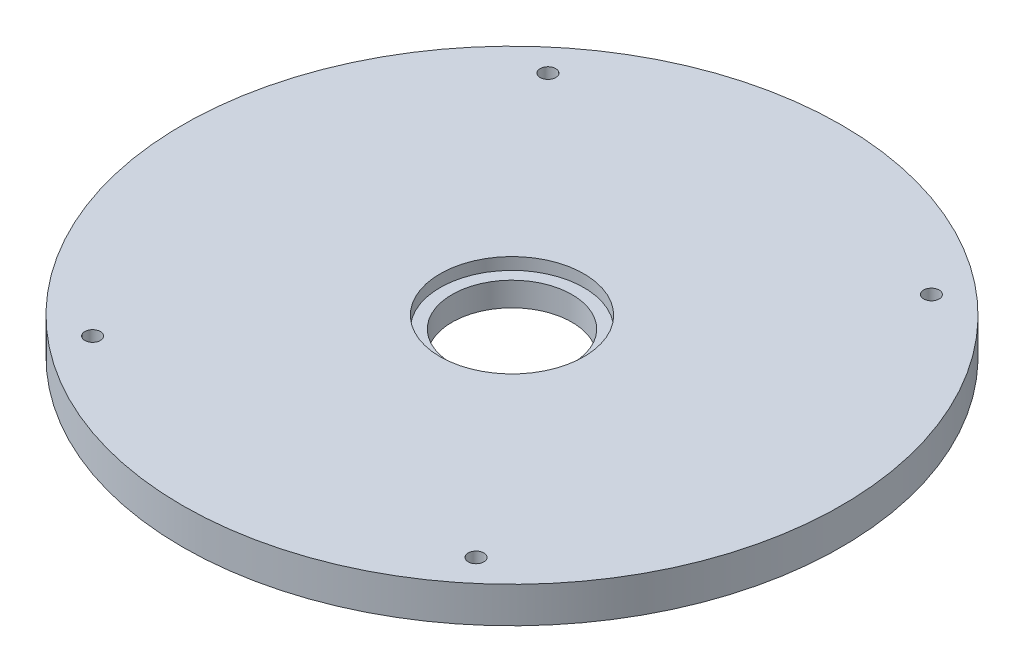
ISO-10303-21;
HEADER;
FILE_DESCRIPTION(('STEP AP214'),'2;1');
FILE_NAME('part.step','',(''),(''),'','','');
FILE_SCHEMA(('AUTOMOTIVE_DESIGN { 1 0 10303 214 1 1 1 1 }'));
ENDSEC;
DATA;
#1=APPLICATION_CONTEXT('core data for automotive mechanical design processes');
#2=APPLICATION_PROTOCOL_DEFINITION('international standard','automotive_design',2000,#1);
#3=PRODUCT_CONTEXT('',#1,'mechanical');
#4=PRODUCT('Part','Part','',(#3));
#5=PRODUCT_RELATED_PRODUCT_CATEGORY('part','',(#4));
#6=PRODUCT_DEFINITION_FORMATION('','',#4);
#7=PRODUCT_DEFINITION_CONTEXT('part definition',#1,'design');
#8=PRODUCT_DEFINITION('design','',#6,#7);
#9=PRODUCT_DEFINITION_SHAPE('','',#8);
#10=(LENGTH_UNIT() NAMED_UNIT(*) SI_UNIT(.MILLI.,.METRE.));
#11=(NAMED_UNIT(*) PLANE_ANGLE_UNIT() SI_UNIT($,.RADIAN.));
#12=(NAMED_UNIT(*) SI_UNIT($,.STERADIAN.) SOLID_ANGLE_UNIT());
#13=UNCERTAINTY_MEASURE_WITH_UNIT(LENGTH_MEASURE(1.E-05),#10,'distance_accuracy_value','');
#14=(GEOMETRIC_REPRESENTATION_CONTEXT(3) GLOBAL_UNCERTAINTY_ASSIGNED_CONTEXT((#13)) GLOBAL_UNIT_ASSIGNED_CONTEXT((#10,
#11,#12)) REPRESENTATION_CONTEXT('',''));
#15=CARTESIAN_POINT('',(0.,0.,0.));
#16=DIRECTION('',(0.,0.,1.));
#17=DIRECTION('',(1.,0.,0.));
#18=AXIS2_PLACEMENT_3D('',#15,#16,#17);
#19=CARTESIAN_POINT('',(0.,15.001,0.));
#20=DIRECTION('',(0.,-1.,0.));
#21=DIRECTION('',(0.,0.,-1.));
#22=AXIS2_PLACEMENT_3D('',#19,#20,#21);
#23=CYLINDRICAL_SURFACE('',#22,25.);
#24=CARTESIAN_POINT('',(0.,0.,0.));
#25=DIRECTION('',(0.,1.,0.));
#26=DIRECTION('',(0.,0.,1.));
#27=AXIS2_PLACEMENT_3D('',#24,#25,#26);
#28=CIRCLE('',#27,25.);
#29=CARTESIAN_POINT('',(0.,0.,25.));
#30=VERTEX_POINT('',#29);
#31=EDGE_CURVE('E59',#30,#30,#28,.T.);
#32=ORIENTED_EDGE('',*,*,#31,.F.);
#33=EDGE_LOOP('',(#32));
#34=FACE_BOUND('',#33,.T.);
#35=CARTESIAN_POINT('',(0.,10.,0.));
#36=DIRECTION('',(0.,1.,0.));
#37=DIRECTION('',(0.,0.,1.));
#38=AXIS2_PLACEMENT_3D('',#35,#36,#37);
#39=CIRCLE('',#38,25.);
#40=CARTESIAN_POINT('',(0.,10.,25.));
#41=VERTEX_POINT('',#40);
#42=EDGE_CURVE('E35',#41,#41,#39,.T.);
#43=ORIENTED_EDGE('',*,*,#42,.T.);
#44=EDGE_LOOP('',(#43));
#45=FACE_BOUND('',#44,.T.);
#46=ADVANCED_FACE('F31',(#34,#45),#23,.F.);
#47=CARTESIAN_POINT('',(0.,15.,0.));
#48=DIRECTION('',(0.,-1.,0.));
#49=DIRECTION('',(0.,0.,-1.));
#50=AXIS2_PLACEMENT_3D('',#47,#48,#49);
#51=CYLINDRICAL_SURFACE('',#50,137.5);
#52=CARTESIAN_POINT('',(0.,15.,0.));
#53=DIRECTION('',(0.,1.,0.));
#54=DIRECTION('',(0.,0.,1.));
#55=AXIS2_PLACEMENT_3D('',#52,#53,#54);
#56=CIRCLE('',#55,137.5);
#57=CARTESIAN_POINT('',(0.,15.,137.5));
#58=VERTEX_POINT('',#57);
#59=EDGE_CURVE('E10',#58,#58,#56,.T.);
#60=ORIENTED_EDGE('',*,*,#59,.F.);
#61=EDGE_LOOP('',(#60));
#62=FACE_BOUND('',#61,.T.);
#63=CARTESIAN_POINT('',(0.,0.,0.));
#64=DIRECTION('',(0.,1.,0.));
#65=DIRECTION('',(0.,0.,1.));
#66=AXIS2_PLACEMENT_3D('',#63,#64,#65);
#67=CIRCLE('',#66,137.5);
#68=CARTESIAN_POINT('',(0.,0.,137.5));
#69=VERTEX_POINT('',#68);
#70=EDGE_CURVE('E39',#69,#69,#67,.T.);
#71=ORIENTED_EDGE('',*,*,#70,.T.);
#72=EDGE_LOOP('',(#71));
#73=FACE_BOUND('',#72,.T.);
#74=ADVANCED_FACE('F33',(#62,#73),#51,.T.);
#75=CARTESIAN_POINT('',(0.,15.,0.));
#76=DIRECTION('',(0.,1.,0.));
#77=DIRECTION('',(0.,0.,1.));
#78=AXIS2_PLACEMENT_3D('',#75,#76,#77);
#79=PLANE('',#78);
#80=CARTESIAN_POINT('',(0.,15.,0.));
#81=DIRECTION('',(0.,1.,0.));
#82=DIRECTION('',(0.,0.,1.));
#83=AXIS2_PLACEMENT_3D('',#80,#81,#82);
#84=CIRCLE('',#83,30.);
#85=CARTESIAN_POINT('',(0.,15.,30.));
#86=VERTEX_POINT('',#85);
#87=EDGE_CURVE('E72',#86,#86,#84,.T.);
#88=ORIENTED_EDGE('',*,*,#87,.F.);
#89=EDGE_LOOP('',(#88));
#90=FACE_BOUND('',#89,.T.);
#91=CARTESIAN_POINT('',(80.,15.,-95.));
#92=DIRECTION('',(0.,1.,0.));
#93=DIRECTION('',(0.,0.,1.));
#94=AXIS2_PLACEMENT_3D('',#91,#92,#93);
#95=CIRCLE('',#94,3.25000000000001);
#96=CARTESIAN_POINT('',(80.,15.,-91.75));
#97=VERTEX_POINT('',#96);
#98=EDGE_CURVE('E52',#97,#97,#95,.T.);
#99=ORIENTED_EDGE('',*,*,#98,.F.);
#100=EDGE_LOOP('',(#99));
#101=FACE_BOUND('',#100,.T.);
#102=CARTESIAN_POINT('',(80.,15.,95.));
#103=DIRECTION('',(0.,1.,0.));
#104=DIRECTION('',(0.,0.,1.));
#105=AXIS2_PLACEMENT_3D('',#102,#103,#104);
#106=CIRCLE('',#105,3.25000000000001);
#107=CARTESIAN_POINT('',(80.,15.,98.25));
#108=VERTEX_POINT('',#107);
#109=EDGE_CURVE('E60',#108,#108,#106,.T.);
#110=ORIENTED_EDGE('',*,*,#109,.F.);
#111=EDGE_LOOP('',(#110));
#112=FACE_BOUND('',#111,.T.);
#113=CARTESIAN_POINT('',(-80.,15.,95.));
#114=DIRECTION('',(0.,1.,0.));
#115=DIRECTION('',(0.,0.,1.));
#116=AXIS2_PLACEMENT_3D('',#113,#114,#115);
#117=CIRCLE('',#116,3.25000000000001);
#118=CARTESIAN_POINT('',(-80.,15.,98.25));
#119=VERTEX_POINT('',#118);
#120=EDGE_CURVE('E51',#119,#119,#117,.T.);
#121=ORIENTED_EDGE('',*,*,#120,.F.);
#122=EDGE_LOOP('',(#121));
#123=FACE_BOUND('',#122,.T.);
#124=CARTESIAN_POINT('',(-80.,15.,-95.));
#125=DIRECTION('',(0.,1.,0.));
#126=DIRECTION('',(0.,0.,1.));
#127=AXIS2_PLACEMENT_3D('',#124,#125,#126);
#128=CIRCLE('',#127,3.25000000000001);
#129=CARTESIAN_POINT('',(-80.,15.,-91.75));
#130=VERTEX_POINT('',#129);
#131=EDGE_CURVE('E44',#130,#130,#128,.T.);
#132=ORIENTED_EDGE('',*,*,#131,.F.);
#133=EDGE_LOOP('',(#132));
#134=FACE_BOUND('',#133,.T.);
#135=ORIENTED_EDGE('',*,*,#59,.T.);
#136=EDGE_LOOP('',(#135));
#137=FACE_BOUND('',#136,.T.);
#138=ADVANCED_FACE('F99',(#90,#101,#112,#123,#134,#137),#79,.T.);
#139=CARTESIAN_POINT('',(0.,0.,0.));
#140=DIRECTION('',(0.,1.,0.));
#141=DIRECTION('',(0.,0.,1.));
#142=AXIS2_PLACEMENT_3D('',#139,#140,#141);
#143=PLANE('',#142);
#144=ORIENTED_EDGE('',*,*,#31,.T.);
#145=EDGE_LOOP('',(#144));
#146=FACE_BOUND('',#145,.T.);
#147=CARTESIAN_POINT('',(80.,0.,-95.));
#148=DIRECTION('',(0.,1.,0.));
#149=DIRECTION('',(0.,0.,1.));
#150=AXIS2_PLACEMENT_3D('',#147,#148,#149);
#151=CIRCLE('',#150,3.25000000000001);
#152=CARTESIAN_POINT('',(80.,0.,-91.75));
#153=VERTEX_POINT('',#152);
#154=EDGE_CURVE('E56',#153,#153,#151,.T.);
#155=ORIENTED_EDGE('',*,*,#154,.T.);
#156=EDGE_LOOP('',(#155));
#157=FACE_BOUND('',#156,.T.);
#158=CARTESIAN_POINT('',(80.,0.,95.));
#159=DIRECTION('',(0.,1.,0.));
#160=DIRECTION('',(0.,0.,1.));
#161=AXIS2_PLACEMENT_3D('',#158,#159,#160);
#162=CIRCLE('',#161,3.25000000000001);
#163=CARTESIAN_POINT('',(80.,0.,98.25));
#164=VERTEX_POINT('',#163);
#165=EDGE_CURVE('E55',#164,#164,#162,.T.);
#166=ORIENTED_EDGE('',*,*,#165,.T.);
#167=EDGE_LOOP('',(#166));
#168=FACE_BOUND('',#167,.T.);
#169=CARTESIAN_POINT('',(-80.,0.,95.));
#170=DIRECTION('',(0.,1.,0.));
#171=DIRECTION('',(0.,0.,1.));
#172=AXIS2_PLACEMENT_3D('',#169,#170,#171);
#173=CIRCLE('',#172,3.25000000000001);
#174=CARTESIAN_POINT('',(-80.,0.,98.25));
#175=VERTEX_POINT('',#174);
#176=EDGE_CURVE('E63',#175,#175,#173,.T.);
#177=ORIENTED_EDGE('',*,*,#176,.T.);
#178=EDGE_LOOP('',(#177));
#179=FACE_BOUND('',#178,.T.);
#180=CARTESIAN_POINT('',(-80.,0.,-95.));
#181=DIRECTION('',(0.,1.,0.));
#182=DIRECTION('',(0.,0.,1.));
#183=AXIS2_PLACEMENT_3D('',#180,#181,#182);
#184=CIRCLE('',#183,3.25000000000001);
#185=CARTESIAN_POINT('',(-80.,0.,-91.75));
#186=VERTEX_POINT('',#185);
#187=EDGE_CURVE('E48',#186,#186,#184,.T.);
#188=ORIENTED_EDGE('',*,*,#187,.T.);
#189=EDGE_LOOP('',(#188));
#190=FACE_BOUND('',#189,.T.);
#191=ORIENTED_EDGE('',*,*,#70,.F.);
#192=EDGE_LOOP('',(#191));
#193=FACE_BOUND('',#192,.T.);
#194=ADVANCED_FACE('F117',(#146,#157,#168,#179,#190,#193),#143,.F.);
#195=CARTESIAN_POINT('',(-80.,24.1923881554251,-95.));
#196=DIRECTION('',(0.,-1.,0.));
#197=DIRECTION('',(0.,0.,-1.));
#198=AXIS2_PLACEMENT_3D('',#195,#196,#197);
#199=CYLINDRICAL_SURFACE('',#198,3.25000000000001);
#200=ORIENTED_EDGE('',*,*,#187,.F.);
#201=EDGE_LOOP('',(#200));
#202=FACE_BOUND('',#201,.T.);
#203=ORIENTED_EDGE('',*,*,#131,.T.);
#204=EDGE_LOOP('',(#203));
#205=FACE_BOUND('',#204,.T.);
#206=ADVANCED_FACE('F107',(#202,#205),#199,.F.);
#207=CARTESIAN_POINT('',(-80.,24.1923881554251,95.));
#208=DIRECTION('',(0.,-1.,0.));
#209=DIRECTION('',(0.,0.,-1.));
#210=AXIS2_PLACEMENT_3D('',#207,#208,#209);
#211=CYLINDRICAL_SURFACE('',#210,3.25000000000001);
#212=ORIENTED_EDGE('',*,*,#176,.F.);
#213=EDGE_LOOP('',(#212));
#214=FACE_BOUND('',#213,.T.);
#215=ORIENTED_EDGE('',*,*,#120,.T.);
#216=EDGE_LOOP('',(#215));
#217=FACE_BOUND('',#216,.T.);
#218=ADVANCED_FACE('F103',(#214,#217),#211,.F.);
#219=CARTESIAN_POINT('',(80.,24.1923881554251,95.));
#220=DIRECTION('',(0.,-1.,0.));
#221=DIRECTION('',(0.,0.,-1.));
#222=AXIS2_PLACEMENT_3D('',#219,#220,#221);
#223=CYLINDRICAL_SURFACE('',#222,3.25000000000001);
#224=ORIENTED_EDGE('',*,*,#165,.F.);
#225=EDGE_LOOP('',(#224));
#226=FACE_BOUND('',#225,.T.);
#227=ORIENTED_EDGE('',*,*,#109,.T.);
#228=EDGE_LOOP('',(#227));
#229=FACE_BOUND('',#228,.T.);
#230=ADVANCED_FACE('F106',(#226,#229),#223,.F.);
#231=CARTESIAN_POINT('',(80.,24.1923881554251,-95.));
#232=DIRECTION('',(0.,-1.,0.));
#233=DIRECTION('',(0.,0.,-1.));
#234=AXIS2_PLACEMENT_3D('',#231,#232,#233);
#235=CYLINDRICAL_SURFACE('',#234,3.25000000000001);
#236=ORIENTED_EDGE('',*,*,#154,.F.);
#237=EDGE_LOOP('',(#236));
#238=FACE_BOUND('',#237,.T.);
#239=ORIENTED_EDGE('',*,*,#98,.T.);
#240=EDGE_LOOP('',(#239));
#241=FACE_BOUND('',#240,.T.);
#242=ADVANCED_FACE('F90',(#238,#241),#235,.F.);
#243=CARTESIAN_POINT('',(0.,10.,0.));
#244=DIRECTION('',(0.,1.,0.));
#245=DIRECTION('',(0.,0.,1.));
#246=AXIS2_PLACEMENT_3D('',#243,#244,#245);
#247=CYLINDRICAL_SURFACE('',#246,30.);
#248=CARTESIAN_POINT('',(0.,10.,0.));
#249=DIRECTION('',(0.,1.,0.));
#250=DIRECTION('',(0.,0.,1.));
#251=AXIS2_PLACEMENT_3D('',#248,#249,#250);
#252=CIRCLE('',#251,30.);
#253=CARTESIAN_POINT('',(0.,10.,30.));
#254=VERTEX_POINT('',#253);
#255=EDGE_CURVE('E75',#254,#254,#252,.T.);
#256=ORIENTED_EDGE('',*,*,#255,.F.);
#257=EDGE_LOOP('',(#256));
#258=FACE_BOUND('',#257,.T.);
#259=ORIENTED_EDGE('',*,*,#87,.T.);
#260=EDGE_LOOP('',(#259));
#261=FACE_BOUND('',#260,.T.);
#262=ADVANCED_FACE('F85',(#258,#261),#247,.F.);
#263=CARTESIAN_POINT('',(0.,10.,0.));
#264=DIRECTION('',(0.,1.,0.));
#265=DIRECTION('',(0.,0.,1.));
#266=AXIS2_PLACEMENT_3D('',#263,#264,#265);
#267=PLANE('',#266);
#268=ORIENTED_EDGE('',*,*,#42,.F.);
#269=EDGE_LOOP('',(#268));
#270=FACE_BOUND('',#269,.T.);
#271=ORIENTED_EDGE('',*,*,#255,.T.);
#272=EDGE_LOOP('',(#271));
#273=FACE_BOUND('',#272,.T.);
#274=ADVANCED_FACE('F83',(#270,#273),#267,.T.);
#275=CLOSED_SHELL('',(#46,#74,#138,#194,#206,#218,#230,#242,#262,#274));
#276=MANIFOLD_SOLID_BREP('B2',#275);
#277=ADVANCED_BREP_SHAPE_REPRESENTATION('',(#18,#276),#14);
#278=SHAPE_DEFINITION_REPRESENTATION(#9,#277);
ENDSEC;
END-ISO-10303-21;
